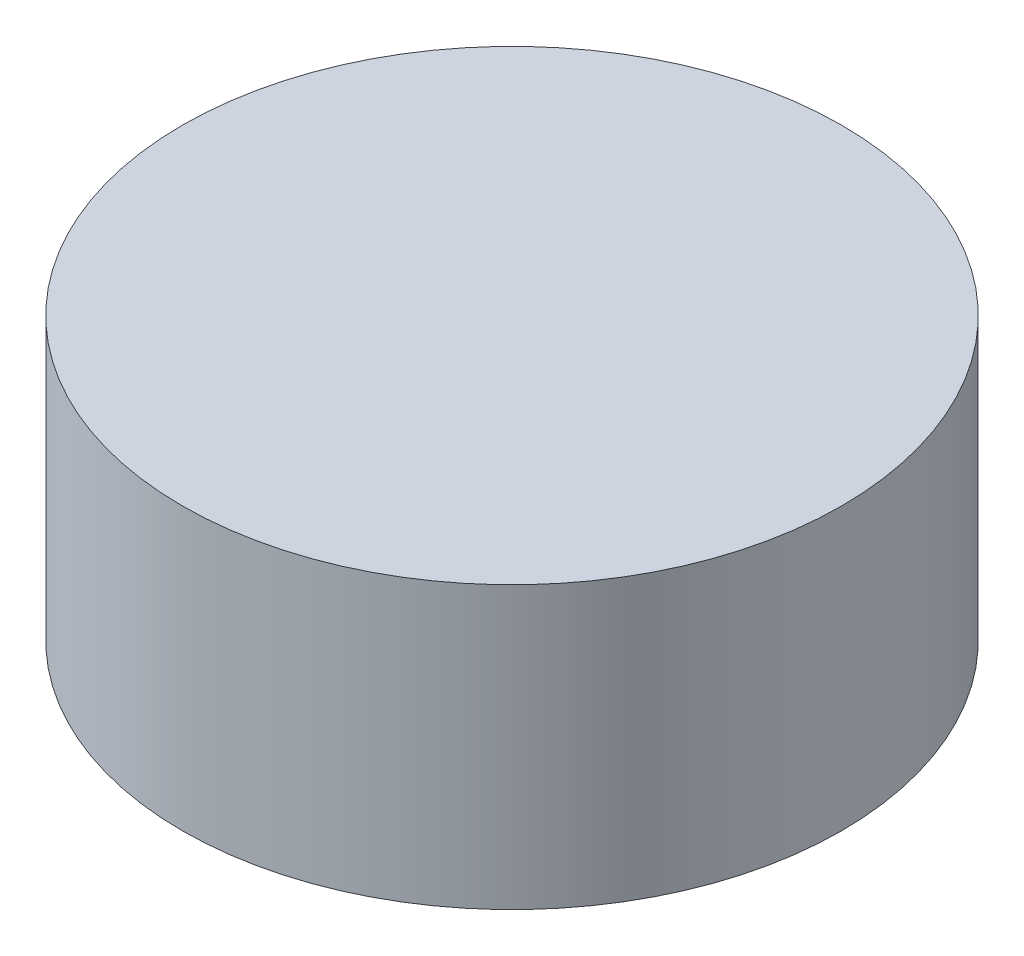
ISO-10303-21;
HEADER;
FILE_DESCRIPTION(('STEP AP214'),'2;1');
FILE_NAME('part.step','',(''),(''),'','','');
FILE_SCHEMA(('AUTOMOTIVE_DESIGN { 1 0 10303 214 1 1 1 1 }'));
ENDSEC;
DATA;
#1=APPLICATION_CONTEXT('core data for automotive mechanical design processes');
#2=APPLICATION_PROTOCOL_DEFINITION('international standard','automotive_design',2000,#1);
#3=PRODUCT_CONTEXT('',#1,'mechanical');
#4=PRODUCT('Part','Part','',(#3));
#5=PRODUCT_RELATED_PRODUCT_CATEGORY('part','',(#4));
#6=PRODUCT_DEFINITION_FORMATION('','',#4);
#7=PRODUCT_DEFINITION_CONTEXT('part definition',#1,'design');
#8=PRODUCT_DEFINITION('design','',#6,#7);
#9=PRODUCT_DEFINITION_SHAPE('','',#8);
#10=(LENGTH_UNIT() NAMED_UNIT(*) SI_UNIT(.MILLI.,.METRE.));
#11=(NAMED_UNIT(*) PLANE_ANGLE_UNIT() SI_UNIT($,.RADIAN.));
#12=(NAMED_UNIT(*) SI_UNIT($,.STERADIAN.) SOLID_ANGLE_UNIT());
#13=UNCERTAINTY_MEASURE_WITH_UNIT(LENGTH_MEASURE(1.E-05),#10,'distance_accuracy_value','');
#14=(GEOMETRIC_REPRESENTATION_CONTEXT(3) GLOBAL_UNCERTAINTY_ASSIGNED_CONTEXT((#13)) GLOBAL_UNIT_ASSIGNED_CONTEXT((#10,
#11,#12)) REPRESENTATION_CONTEXT('',''));
#15=CARTESIAN_POINT('',(0.,0.,0.));
#16=DIRECTION('',(0.,0.,1.));
#17=DIRECTION('',(1.,0.,0.));
#18=AXIS2_PLACEMENT_3D('',#15,#16,#17);
#19=CARTESIAN_POINT('',(0.,8.128,0.));
#20=DIRECTION('',(0.,-1.,0.));
#21=DIRECTION('',(0.,0.,-1.));
#22=AXIS2_PLACEMENT_3D('',#19,#20,#21);
#23=CYLINDRICAL_SURFACE('',#22,9.525);
#24=CARTESIAN_POINT('',(0.,8.128,0.));
#25=DIRECTION('',(0.,1.,0.));
#26=DIRECTION('',(0.,0.,1.));
#27=AXIS2_PLACEMENT_3D('',#24,#25,#26);
#28=CIRCLE('',#27,9.525);
#29=CARTESIAN_POINT('',(0.,8.128,9.525));
#30=VERTEX_POINT('',#29);
#31=EDGE_CURVE('E10',#30,#30,#28,.T.);
#32=ORIENTED_EDGE('',*,*,#31,.F.);
#33=EDGE_LOOP('',(#32));
#34=FACE_BOUND('',#33,.T.);
#35=CARTESIAN_POINT('',(0.,0.,0.));
#36=DIRECTION('',(0.,1.,0.));
#37=DIRECTION('',(0.,0.,1.));
#38=AXIS2_PLACEMENT_3D('',#35,#36,#37);
#39=CIRCLE('',#38,9.525);
#40=CARTESIAN_POINT('',(0.,0.,9.525));
#41=VERTEX_POINT('',#40);
#42=EDGE_CURVE('E40',#41,#41,#39,.T.);
#43=ORIENTED_EDGE('',*,*,#42,.T.);
#44=EDGE_LOOP('',(#43));
#45=FACE_BOUND('',#44,.T.);
#46=ADVANCED_FACE('F37',(#34,#45),#23,.T.);
#47=CARTESIAN_POINT('',(0.,8.128,0.));
#48=DIRECTION('',(0.,1.,0.));
#49=DIRECTION('',(0.,0.,1.));
#50=AXIS2_PLACEMENT_3D('',#47,#48,#49);
#51=PLANE('',#50);
#52=ORIENTED_EDGE('',*,*,#31,.T.);
#53=EDGE_LOOP('',(#52));
#54=FACE_BOUND('',#53,.T.);
#55=ADVANCED_FACE('F54',(#54),#51,.T.);
#56=CARTESIAN_POINT('',(0.,0.,0.));
#57=DIRECTION('',(0.,1.,0.));
#58=DIRECTION('',(0.,0.,1.));
#59=AXIS2_PLACEMENT_3D('',#56,#57,#58);
#60=PLANE('',#59);
#61=ORIENTED_EDGE('',*,*,#42,.F.);
#62=EDGE_LOOP('',(#61));
#63=FACE_BOUND('',#62,.T.);
#64=ADVANCED_FACE('F52',(#63),#60,.F.);
#65=CLOSED_SHELL('',(#46,#55,#64));
#66=MANIFOLD_SOLID_BREP('B2',#65);
#67=ADVANCED_BREP_SHAPE_REPRESENTATION('',(#18,#66),#14);
#68=SHAPE_DEFINITION_REPRESENTATION(#9,#67);
ENDSEC;
END-ISO-10303-21;
